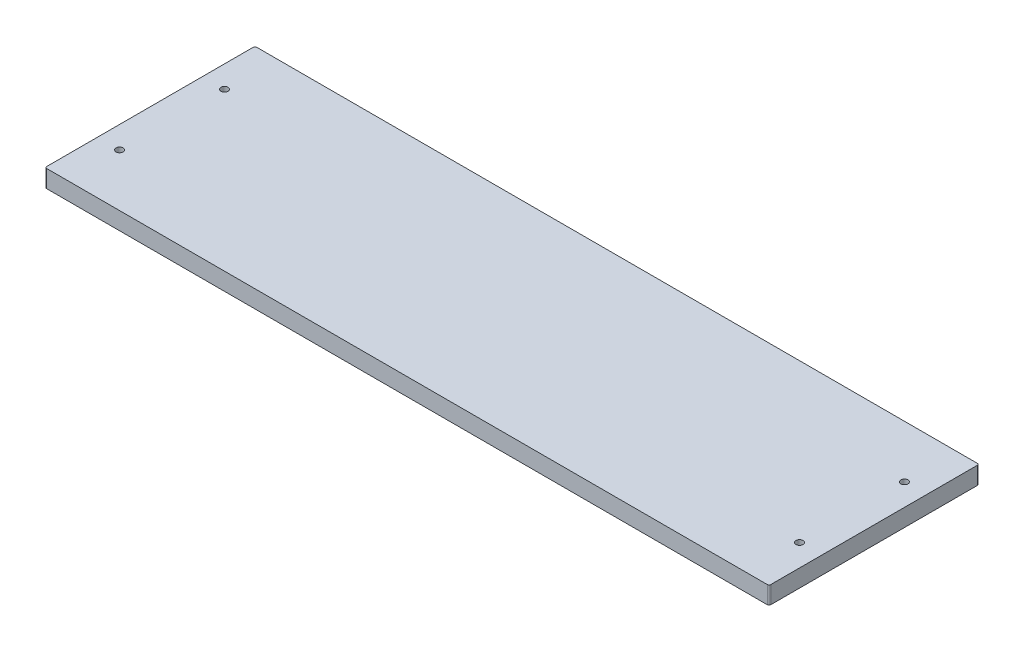
ISO-10303-21;
HEADER;
FILE_DESCRIPTION(('STEP AP214'),'2;1');
FILE_NAME('part.step','',(''),(''),'','','');
FILE_SCHEMA(('AUTOMOTIVE_DESIGN { 1 0 10303 214 1 1 1 1 }'));
ENDSEC;
DATA;
#1=APPLICATION_CONTEXT('core data for automotive mechanical design processes');
#2=APPLICATION_PROTOCOL_DEFINITION('international standard','automotive_design',2000,#1);
#3=PRODUCT_CONTEXT('',#1,'mechanical');
#4=PRODUCT('Part','Part','',(#3));
#5=PRODUCT_RELATED_PRODUCT_CATEGORY('part','',(#4));
#6=PRODUCT_DEFINITION_FORMATION('','',#4);
#7=PRODUCT_DEFINITION_CONTEXT('part definition',#1,'design');
#8=PRODUCT_DEFINITION('design','',#6,#7);
#9=PRODUCT_DEFINITION_SHAPE('','',#8);
#10=(LENGTH_UNIT() NAMED_UNIT(*) SI_UNIT(.MILLI.,.METRE.));
#11=(NAMED_UNIT(*) PLANE_ANGLE_UNIT() SI_UNIT($,.RADIAN.));
#12=(NAMED_UNIT(*) SI_UNIT($,.STERADIAN.) SOLID_ANGLE_UNIT());
#13=UNCERTAINTY_MEASURE_WITH_UNIT(LENGTH_MEASURE(1.E-05),#10,'distance_accuracy_value','');
#14=(GEOMETRIC_REPRESENTATION_CONTEXT(3) GLOBAL_UNCERTAINTY_ASSIGNED_CONTEXT((#13)) GLOBAL_UNIT_ASSIGNED_CONTEXT((#10,
#11,#12)) REPRESENTATION_CONTEXT('',''));
#15=CARTESIAN_POINT('',(0.,0.,0.));
#16=DIRECTION('',(0.,0.,1.));
#17=DIRECTION('',(1.,0.,0.));
#18=AXIS2_PLACEMENT_3D('',#15,#16,#17);
#19=CARTESIAN_POINT('',(262.73125,12.7,76.2));
#20=DIRECTION('',(-1.,0.,0.));
#21=DIRECTION('',(0.,0.,1.));
#22=AXIS2_PLACEMENT_3D('',#19,#20,#21);
#23=PLANE('',#22);
#24=DIRECTION('',(0.,0.,-1.));
#25=VECTOR('',#24,1.);
#26=CARTESIAN_POINT('',(262.73125,12.7,76.2));
#27=LINE('',#26,#25);
#28=CARTESIAN_POINT('',(262.73125,12.7,74.93));
#29=VERTEX_POINT('',#28);
#30=CARTESIAN_POINT('',(262.73125,12.7,-74.9299999999999));
#31=VERTEX_POINT('',#30);
#32=EDGE_CURVE('E117',#29,#31,#27,.T.);
#33=ORIENTED_EDGE('',*,*,#32,.F.);
#34=DIRECTION('',(0.,-1.,0.));
#35=VECTOR('',#34,1.);
#36=CARTESIAN_POINT('',(262.73125,12.7,74.93));
#37=LINE('',#36,#35);
#38=CARTESIAN_POINT('',(262.73125,0.,74.93));
#39=VERTEX_POINT('',#38);
#40=EDGE_CURVE('E102',#29,#39,#37,.T.);
#41=ORIENTED_EDGE('',*,*,#40,.T.);
#42=DIRECTION('',(0.,0.,-1.));
#43=VECTOR('',#42,1.);
#44=CARTESIAN_POINT('',(262.73125,0.,76.2));
#45=LINE('',#44,#43);
#46=CARTESIAN_POINT('',(262.73125,0.,-74.9299999999999));
#47=VERTEX_POINT('',#46);
#48=EDGE_CURVE('E114',#39,#47,#45,.T.);
#49=ORIENTED_EDGE('',*,*,#48,.T.);
#50=DIRECTION('',(0.,-1.,0.));
#51=VECTOR('',#50,1.);
#52=CARTESIAN_POINT('',(262.73125,12.7,-74.93));
#53=LINE('',#52,#51);
#54=EDGE_CURVE('E119',#47,#31,#53,.F.);
#55=ORIENTED_EDGE('',*,*,#54,.T.);
#56=EDGE_LOOP('',(#33,#41,#49,#55));
#57=FACE_BOUND('',#56,.T.);
#58=ADVANCED_FACE('F33',(#57),#23,.F.);
#59=CARTESIAN_POINT('',(-262.73125,12.7,-76.2));
#60=DIRECTION('',(0.,0.,1.));
#61=DIRECTION('',(1.,0.,0.));
#62=AXIS2_PLACEMENT_3D('',#59,#60,#61);
#63=PLANE('',#62);
#64=DIRECTION('',(-1.,0.,0.));
#65=VECTOR('',#64,1.);
#66=CARTESIAN_POINT('',(-262.73125,12.7,-76.2));
#67=LINE('',#66,#65);
#68=CARTESIAN_POINT('',(261.46125,12.7,-76.2));
#69=VERTEX_POINT('',#68);
#70=CARTESIAN_POINT('',(-261.46125,12.7,-76.2));
#71=VERTEX_POINT('',#70);
#72=EDGE_CURVE('E172',#69,#71,#67,.T.);
#73=ORIENTED_EDGE('',*,*,#72,.F.);
#74=DIRECTION('',(0.,-1.,0.));
#75=VECTOR('',#74,1.);
#76=CARTESIAN_POINT('',(261.46125,12.7,-76.2));
#77=LINE('',#76,#75);
#78=CARTESIAN_POINT('',(261.46125,0.,-76.2));
#79=VERTEX_POINT('',#78);
#80=EDGE_CURVE('E156',#69,#79,#77,.T.);
#81=ORIENTED_EDGE('',*,*,#80,.T.);
#82=DIRECTION('',(-1.,0.,0.));
#83=VECTOR('',#82,1.);
#84=CARTESIAN_POINT('',(-262.73125,0.,-76.2));
#85=LINE('',#84,#83);
#86=CARTESIAN_POINT('',(-261.46125,0.,-76.2));
#87=VERTEX_POINT('',#86);
#88=EDGE_CURVE('E123',#79,#87,#85,.T.);
#89=ORIENTED_EDGE('',*,*,#88,.T.);
#90=DIRECTION('',(0.,-1.,0.));
#91=VECTOR('',#90,1.);
#92=CARTESIAN_POINT('',(-261.46125,12.7,-76.2));
#93=LINE('',#92,#91);
#94=EDGE_CURVE('E154',#87,#71,#93,.F.);
#95=ORIENTED_EDGE('',*,*,#94,.T.);
#96=EDGE_LOOP('',(#73,#81,#89,#95));
#97=FACE_BOUND('',#96,.T.);
#98=ADVANCED_FACE('F225',(#97),#63,.F.);
#99=CARTESIAN_POINT('',(-262.73125,12.7,76.2));
#100=DIRECTION('',(1.,0.,0.));
#101=DIRECTION('',(0.,0.,-1.));
#102=AXIS2_PLACEMENT_3D('',#99,#100,#101);
#103=PLANE('',#102);
#104=DIRECTION('',(0.,0.,1.));
#105=VECTOR('',#104,1.);
#106=CARTESIAN_POINT('',(-262.73125,0.,76.2));
#107=LINE('',#106,#105);
#108=CARTESIAN_POINT('',(-262.73125,0.,-74.9299999999999));
#109=VERTEX_POINT('',#108);
#110=CARTESIAN_POINT('',(-262.73125,0.,74.93));
#111=VERTEX_POINT('',#110);
#112=EDGE_CURVE('E127',#109,#111,#107,.T.);
#113=ORIENTED_EDGE('',*,*,#112,.T.);
#114=DIRECTION('',(0.,-1.,0.));
#115=VECTOR('',#114,1.);
#116=CARTESIAN_POINT('',(-262.73125,12.7,74.93));
#117=LINE('',#116,#115);
#118=CARTESIAN_POINT('',(-262.73125,12.7,74.93));
#119=VERTEX_POINT('',#118);
#120=EDGE_CURVE('E11',#111,#119,#117,.F.);
#121=ORIENTED_EDGE('',*,*,#120,.T.);
#122=DIRECTION('',(0.,0.,1.));
#123=VECTOR('',#122,1.);
#124=CARTESIAN_POINT('',(-262.73125,12.7,76.2));
#125=LINE('',#124,#123);
#126=CARTESIAN_POINT('',(-262.73125,12.7,-74.9299999999999));
#127=VERTEX_POINT('',#126);
#128=EDGE_CURVE('E162',#127,#119,#125,.T.);
#129=ORIENTED_EDGE('',*,*,#128,.F.);
#130=DIRECTION('',(0.,-1.,0.));
#131=VECTOR('',#130,1.);
#132=CARTESIAN_POINT('',(-262.73125,12.7,-74.93));
#133=LINE('',#132,#131);
#134=EDGE_CURVE('E41',#127,#109,#133,.T.);
#135=ORIENTED_EDGE('',*,*,#134,.T.);
#136=EDGE_LOOP('',(#113,#121,#129,#135));
#137=FACE_BOUND('',#136,.T.);
#138=ADVANCED_FACE('F161',(#137),#103,.F.);
#139=CARTESIAN_POINT('',(-262.73125,12.7,76.2));
#140=DIRECTION('',(0.,0.,-1.));
#141=DIRECTION('',(-1.,0.,0.));
#142=AXIS2_PLACEMENT_3D('',#139,#140,#141);
#143=PLANE('',#142);
#144=DIRECTION('',(1.,0.,0.));
#145=VECTOR('',#144,1.);
#146=CARTESIAN_POINT('',(-262.73125,0.,76.2));
#147=LINE('',#146,#145);
#148=CARTESIAN_POINT('',(-261.46125,0.,76.2));
#149=VERTEX_POINT('',#148);
#150=CARTESIAN_POINT('',(261.46125,0.,76.2));
#151=VERTEX_POINT('',#150);
#152=EDGE_CURVE('E137',#149,#151,#147,.T.);
#153=ORIENTED_EDGE('',*,*,#152,.T.);
#154=DIRECTION('',(0.,-1.,0.));
#155=VECTOR('',#154,1.);
#156=CARTESIAN_POINT('',(261.46125,12.7,76.2));
#157=LINE('',#156,#155);
#158=CARTESIAN_POINT('',(261.46125,12.7,76.2));
#159=VERTEX_POINT('',#158);
#160=EDGE_CURVE('E103',#151,#159,#157,.F.);
#161=ORIENTED_EDGE('',*,*,#160,.T.);
#162=DIRECTION('',(1.,0.,0.));
#163=VECTOR('',#162,1.);
#164=CARTESIAN_POINT('',(-262.73125,12.7,76.2));
#165=LINE('',#164,#163);
#166=CARTESIAN_POINT('',(-261.46125,12.7,76.2));
#167=VERTEX_POINT('',#166);
#168=EDGE_CURVE('E133',#167,#159,#165,.T.);
#169=ORIENTED_EDGE('',*,*,#168,.F.);
#170=DIRECTION('',(0.,-1.,0.));
#171=VECTOR('',#170,1.);
#172=CARTESIAN_POINT('',(-261.46125,12.7,76.2));
#173=LINE('',#172,#171);
#174=EDGE_CURVE('E108',#167,#149,#173,.T.);
#175=ORIENTED_EDGE('',*,*,#174,.T.);
#176=EDGE_LOOP('',(#153,#161,#169,#175));
#177=FACE_BOUND('',#176,.T.);
#178=ADVANCED_FACE('F170',(#177),#143,.F.);
#179=CARTESIAN_POINT('',(0.,12.7,0.));
#180=DIRECTION('',(0.,-1.,0.));
#181=DIRECTION('',(0.,0.,-1.));
#182=AXIS2_PLACEMENT_3D('',#179,#180,#181);
#183=PLANE('',#182);
#184=CARTESIAN_POINT('',(-246.72925,12.7,-38.1));
#185=DIRECTION('',(0.,1.,0.));
#186=DIRECTION('',(0.,0.,1.));
#187=AXIS2_PLACEMENT_3D('',#184,#185,#186);
#188=CIRCLE('',#187,2.55269999999999);
#189=CARTESIAN_POINT('',(-246.72925,12.7,-35.5473));
#190=VERTEX_POINT('',#189);
#191=EDGE_CURVE('E193',#190,#190,#188,.T.);
#192=ORIENTED_EDGE('',*,*,#191,.F.);
#193=EDGE_LOOP('',(#192));
#194=FACE_BOUND('',#193,.T.);
#195=CARTESIAN_POINT('',(-246.72925,12.7,38.1));
#196=DIRECTION('',(0.,1.,0.));
#197=DIRECTION('',(0.,0.,1.));
#198=AXIS2_PLACEMENT_3D('',#195,#196,#197);
#199=CIRCLE('',#198,2.55269999999999);
#200=CARTESIAN_POINT('',(-246.72925,12.7,40.6527));
#201=VERTEX_POINT('',#200);
#202=EDGE_CURVE('E187',#201,#201,#199,.T.);
#203=ORIENTED_EDGE('',*,*,#202,.F.);
#204=EDGE_LOOP('',(#203));
#205=FACE_BOUND('',#204,.T.);
#206=CARTESIAN_POINT('',(246.72925,12.7,-38.1));
#207=DIRECTION('',(0.,1.,0.));
#208=DIRECTION('',(0.,0.,1.));
#209=AXIS2_PLACEMENT_3D('',#206,#207,#208);
#210=CIRCLE('',#209,2.55269999999999);
#211=CARTESIAN_POINT('',(246.72925,12.7,-35.5473));
#212=VERTEX_POINT('',#211);
#213=EDGE_CURVE('E181',#212,#212,#210,.T.);
#214=ORIENTED_EDGE('',*,*,#213,.F.);
#215=EDGE_LOOP('',(#214));
#216=FACE_BOUND('',#215,.T.);
#217=CARTESIAN_POINT('',(246.72925,12.7,38.1));
#218=DIRECTION('',(0.,1.,0.));
#219=DIRECTION('',(0.,0.,1.));
#220=AXIS2_PLACEMENT_3D('',#217,#218,#219);
#221=CIRCLE('',#220,2.55269999999999);
#222=CARTESIAN_POINT('',(246.72925,12.7,40.6527));
#223=VERTEX_POINT('',#222);
#224=EDGE_CURVE('E130',#223,#223,#221,.T.);
#225=ORIENTED_EDGE('',*,*,#224,.F.);
#226=EDGE_LOOP('',(#225));
#227=FACE_BOUND('',#226,.T.);
#228=ORIENTED_EDGE('',*,*,#168,.T.);
#229=CARTESIAN_POINT('',(261.46125,12.7,74.93));
#230=DIRECTION('',(0.,-1.,0.));
#231=DIRECTION('',(0.,0.,-1.));
#232=AXIS2_PLACEMENT_3D('',#229,#230,#231);
#233=CIRCLE('',#232,1.27);
#234=EDGE_CURVE('E152',#159,#29,#233,.F.);
#235=ORIENTED_EDGE('',*,*,#234,.T.);
#236=ORIENTED_EDGE('',*,*,#32,.T.);
#237=CARTESIAN_POINT('',(261.46125,12.7,-74.93));
#238=DIRECTION('',(0.,-1.,0.));
#239=DIRECTION('',(0.,0.,-1.));
#240=AXIS2_PLACEMENT_3D('',#237,#238,#239);
#241=CIRCLE('',#240,1.27);
#242=EDGE_CURVE('E150',#31,#69,#241,.F.);
#243=ORIENTED_EDGE('',*,*,#242,.T.);
#244=ORIENTED_EDGE('',*,*,#72,.T.);
#245=CARTESIAN_POINT('',(-261.46125,12.7,-74.93));
#246=DIRECTION('',(0.,-1.,0.));
#247=DIRECTION('',(0.,0.,-1.));
#248=AXIS2_PLACEMENT_3D('',#245,#246,#247);
#249=CIRCLE('',#248,1.27);
#250=EDGE_CURVE('E53',#71,#127,#249,.F.);
#251=ORIENTED_EDGE('',*,*,#250,.T.);
#252=ORIENTED_EDGE('',*,*,#128,.T.);
#253=CARTESIAN_POINT('',(-261.46125,12.7,74.93));
#254=DIRECTION('',(0.,-1.,0.));
#255=DIRECTION('',(0.,0.,-1.));
#256=AXIS2_PLACEMENT_3D('',#253,#254,#255);
#257=CIRCLE('',#256,1.27);
#258=EDGE_CURVE('E148',#119,#167,#257,.F.);
#259=ORIENTED_EDGE('',*,*,#258,.T.);
#260=EDGE_LOOP('',(#228,#235,#236,#243,#244,#251,#252,#259));
#261=FACE_BOUND('',#260,.T.);
#262=ADVANCED_FACE('F199',(#194,#205,#216,#227,#261),#183,.F.);
#263=CARTESIAN_POINT('',(0.,0.,0.));
#264=DIRECTION('',(0.,-1.,0.));
#265=DIRECTION('',(0.,0.,-1.));
#266=AXIS2_PLACEMENT_3D('',#263,#264,#265);
#267=PLANE('',#266);
#268=CARTESIAN_POINT('',(-246.72925,0.,-38.1));
#269=DIRECTION('',(0.,1.,0.));
#270=DIRECTION('',(0.,0.,1.));
#271=AXIS2_PLACEMENT_3D('',#268,#269,#270);
#272=CIRCLE('',#271,2.55269999999999);
#273=CARTESIAN_POINT('',(-246.72925,0.,-35.5473));
#274=VERTEX_POINT('',#273);
#275=EDGE_CURVE('E190',#274,#274,#272,.T.);
#276=ORIENTED_EDGE('',*,*,#275,.T.);
#277=EDGE_LOOP('',(#276));
#278=FACE_BOUND('',#277,.T.);
#279=CARTESIAN_POINT('',(-246.72925,0.,38.1));
#280=DIRECTION('',(0.,1.,0.));
#281=DIRECTION('',(0.,0.,1.));
#282=AXIS2_PLACEMENT_3D('',#279,#280,#281);
#283=CIRCLE('',#282,2.55269999999999);
#284=CARTESIAN_POINT('',(-246.72925,0.,40.6527));
#285=VERTEX_POINT('',#284);
#286=EDGE_CURVE('E184',#285,#285,#283,.T.);
#287=ORIENTED_EDGE('',*,*,#286,.T.);
#288=EDGE_LOOP('',(#287));
#289=FACE_BOUND('',#288,.T.);
#290=CARTESIAN_POINT('',(246.72925,0.,-38.1));
#291=DIRECTION('',(0.,1.,0.));
#292=DIRECTION('',(0.,0.,1.));
#293=AXIS2_PLACEMENT_3D('',#290,#291,#292);
#294=CIRCLE('',#293,2.55269999999999);
#295=CARTESIAN_POINT('',(246.72925,0.,-35.5473));
#296=VERTEX_POINT('',#295);
#297=EDGE_CURVE('E178',#296,#296,#294,.T.);
#298=ORIENTED_EDGE('',*,*,#297,.T.);
#299=EDGE_LOOP('',(#298));
#300=FACE_BOUND('',#299,.T.);
#301=CARTESIAN_POINT('',(246.72925,0.,38.1));
#302=DIRECTION('',(0.,1.,0.));
#303=DIRECTION('',(0.,0.,1.));
#304=AXIS2_PLACEMENT_3D('',#301,#302,#303);
#305=CIRCLE('',#304,2.55269999999999);
#306=CARTESIAN_POINT('',(246.72925,0.,40.6527));
#307=VERTEX_POINT('',#306);
#308=EDGE_CURVE('E124',#307,#307,#305,.T.);
#309=ORIENTED_EDGE('',*,*,#308,.T.);
#310=EDGE_LOOP('',(#309));
#311=FACE_BOUND('',#310,.T.);
#312=ORIENTED_EDGE('',*,*,#48,.F.);
#313=CARTESIAN_POINT('',(261.46125,0.,74.93));
#314=DIRECTION('',(0.,-1.,0.));
#315=DIRECTION('',(0.,0.,-1.));
#316=AXIS2_PLACEMENT_3D('',#313,#314,#315);
#317=CIRCLE('',#316,1.27);
#318=EDGE_CURVE('E98',#39,#151,#317,.T.);
#319=ORIENTED_EDGE('',*,*,#318,.T.);
#320=ORIENTED_EDGE('',*,*,#152,.F.);
#321=CARTESIAN_POINT('',(-261.46125,0.,74.93));
#322=DIRECTION('',(0.,-1.,0.));
#323=DIRECTION('',(0.,0.,-1.));
#324=AXIS2_PLACEMENT_3D('',#321,#322,#323);
#325=CIRCLE('',#324,1.27);
#326=EDGE_CURVE('E141',#149,#111,#325,.T.);
#327=ORIENTED_EDGE('',*,*,#326,.T.);
#328=ORIENTED_EDGE('',*,*,#112,.F.);
#329=CARTESIAN_POINT('',(-261.46125,0.,-74.93));
#330=DIRECTION('',(0.,-1.,0.));
#331=DIRECTION('',(0.,0.,-1.));
#332=AXIS2_PLACEMENT_3D('',#329,#330,#331);
#333=CIRCLE('',#332,1.27);
#334=EDGE_CURVE('E118',#109,#87,#333,.T.);
#335=ORIENTED_EDGE('',*,*,#334,.T.);
#336=ORIENTED_EDGE('',*,*,#88,.F.);
#337=CARTESIAN_POINT('',(261.46125,0.,-74.93));
#338=DIRECTION('',(0.,-1.,0.));
#339=DIRECTION('',(0.,0.,-1.));
#340=AXIS2_PLACEMENT_3D('',#337,#338,#339);
#341=CIRCLE('',#340,1.27);
#342=EDGE_CURVE('E109',#79,#47,#341,.T.);
#343=ORIENTED_EDGE('',*,*,#342,.T.);
#344=EDGE_LOOP('',(#312,#319,#320,#327,#328,#335,#336,#343));
#345=FACE_BOUND('',#344,.T.);
#346=ADVANCED_FACE('F121',(#278,#289,#300,#311,#345),#267,.T.);
#347=CARTESIAN_POINT('',(246.72925,12.7,38.1));
#348=DIRECTION('',(0.,1.,0.));
#349=DIRECTION('',(0.,0.,1.));
#350=AXIS2_PLACEMENT_3D('',#347,#348,#349);
#351=CYLINDRICAL_SURFACE('',#350,2.55269999999999);
#352=ORIENTED_EDGE('',*,*,#308,.F.);
#353=EDGE_LOOP('',(#352));
#354=FACE_BOUND('',#353,.T.);
#355=ORIENTED_EDGE('',*,*,#224,.T.);
#356=EDGE_LOOP('',(#355));
#357=FACE_BOUND('',#356,.T.);
#358=ADVANCED_FACE('F209',(#354,#357),#351,.F.);
#359=CARTESIAN_POINT('',(246.72925,12.7,-38.1));
#360=DIRECTION('',(0.,1.,0.));
#361=DIRECTION('',(0.,0.,1.));
#362=AXIS2_PLACEMENT_3D('',#359,#360,#361);
#363=CYLINDRICAL_SURFACE('',#362,2.55269999999999);
#364=ORIENTED_EDGE('',*,*,#297,.F.);
#365=EDGE_LOOP('',(#364));
#366=FACE_BOUND('',#365,.T.);
#367=ORIENTED_EDGE('',*,*,#213,.T.);
#368=EDGE_LOOP('',(#367));
#369=FACE_BOUND('',#368,.T.);
#370=ADVANCED_FACE('F211',(#366,#369),#363,.F.);
#371=CARTESIAN_POINT('',(-246.72925,12.7,38.1));
#372=DIRECTION('',(0.,1.,0.));
#373=DIRECTION('',(0.,0.,1.));
#374=AXIS2_PLACEMENT_3D('',#371,#372,#373);
#375=CYLINDRICAL_SURFACE('',#374,2.55269999999999);
#376=ORIENTED_EDGE('',*,*,#286,.F.);
#377=EDGE_LOOP('',(#376));
#378=FACE_BOUND('',#377,.T.);
#379=ORIENTED_EDGE('',*,*,#202,.T.);
#380=EDGE_LOOP('',(#379));
#381=FACE_BOUND('',#380,.T.);
#382=ADVANCED_FACE('F218',(#378,#381),#375,.F.);
#383=CARTESIAN_POINT('',(-246.72925,12.7,-38.1));
#384=DIRECTION('',(0.,1.,0.));
#385=DIRECTION('',(0.,0.,1.));
#386=AXIS2_PLACEMENT_3D('',#383,#384,#385);
#387=CYLINDRICAL_SURFACE('',#386,2.55269999999999);
#388=ORIENTED_EDGE('',*,*,#275,.F.);
#389=EDGE_LOOP('',(#388));
#390=FACE_BOUND('',#389,.T.);
#391=ORIENTED_EDGE('',*,*,#191,.T.);
#392=EDGE_LOOP('',(#391));
#393=FACE_BOUND('',#392,.T.);
#394=ADVANCED_FACE('F197',(#390,#393),#387,.F.);
#395=CARTESIAN_POINT('',(261.46125,12.7,74.93));
#396=DIRECTION('',(0.,-1.,0.));
#397=DIRECTION('',(0.,0.,-1.));
#398=AXIS2_PLACEMENT_3D('',#395,#396,#397);
#399=CYLINDRICAL_SURFACE('',#398,1.27);
#400=ORIENTED_EDGE('',*,*,#234,.F.);
#401=ORIENTED_EDGE('',*,*,#160,.F.);
#402=ORIENTED_EDGE('',*,*,#318,.F.);
#403=ORIENTED_EDGE('',*,*,#40,.F.);
#404=EDGE_LOOP('',(#400,#401,#402,#403));
#405=FACE_BOUND('',#404,.T.);
#406=ADVANCED_FACE('F101',(#405),#399,.T.);
#407=CARTESIAN_POINT('',(261.46125,12.7,-74.93));
#408=DIRECTION('',(0.,-1.,0.));
#409=DIRECTION('',(0.,0.,-1.));
#410=AXIS2_PLACEMENT_3D('',#407,#408,#409);
#411=CYLINDRICAL_SURFACE('',#410,1.27);
#412=ORIENTED_EDGE('',*,*,#242,.F.);
#413=ORIENTED_EDGE('',*,*,#54,.F.);
#414=ORIENTED_EDGE('',*,*,#342,.F.);
#415=ORIENTED_EDGE('',*,*,#80,.F.);
#416=EDGE_LOOP('',(#412,#413,#414,#415));
#417=FACE_BOUND('',#416,.T.);
#418=ADVANCED_FACE('F236',(#417),#411,.T.);
#419=CARTESIAN_POINT('',(-261.46125,12.7,74.93));
#420=DIRECTION('',(0.,-1.,0.));
#421=DIRECTION('',(0.,0.,-1.));
#422=AXIS2_PLACEMENT_3D('',#419,#420,#421);
#423=CYLINDRICAL_SURFACE('',#422,1.27);
#424=ORIENTED_EDGE('',*,*,#258,.F.);
#425=ORIENTED_EDGE('',*,*,#120,.F.);
#426=ORIENTED_EDGE('',*,*,#326,.F.);
#427=ORIENTED_EDGE('',*,*,#174,.F.);
#428=EDGE_LOOP('',(#424,#425,#426,#427));
#429=FACE_BOUND('',#428,.T.);
#430=ADVANCED_FACE('F167',(#429),#423,.T.);
#431=CARTESIAN_POINT('',(-261.46125,12.7,-74.93));
#432=DIRECTION('',(0.,-1.,0.));
#433=DIRECTION('',(0.,0.,-1.));
#434=AXIS2_PLACEMENT_3D('',#431,#432,#433);
#435=CYLINDRICAL_SURFACE('',#434,1.27);
#436=ORIENTED_EDGE('',*,*,#250,.F.);
#437=ORIENTED_EDGE('',*,*,#94,.F.);
#438=ORIENTED_EDGE('',*,*,#334,.F.);
#439=ORIENTED_EDGE('',*,*,#134,.F.);
#440=EDGE_LOOP('',(#436,#437,#438,#439));
#441=FACE_BOUND('',#440,.T.);
#442=ADVANCED_FACE('F35',(#441),#435,.T.);
#443=CLOSED_SHELL('',(#58,#98,#138,#178,#262,#346,#358,#370,#382,#394,#406,#418,#430,#442));
#444=MANIFOLD_SOLID_BREP('B2',#443);
#445=ADVANCED_BREP_SHAPE_REPRESENTATION('',(#18,#444),#14);
#446=SHAPE_DEFINITION_REPRESENTATION(#9,#445);
ENDSEC;
END-ISO-10303-21;
